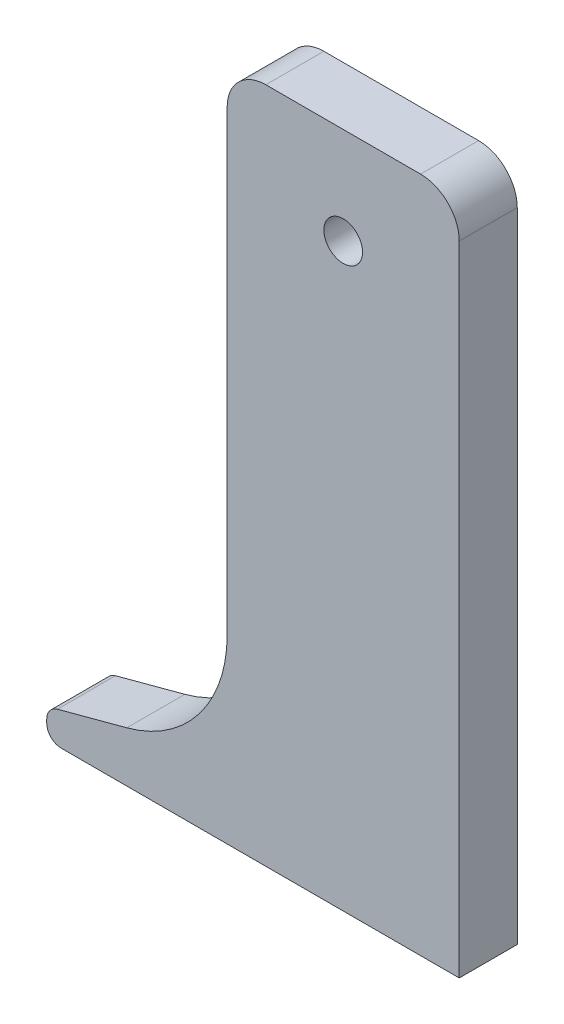
ISO-10303-21;
HEADER;
FILE_DESCRIPTION(('STEP AP214'),'2;1');
FILE_NAME('part.step','',(''),(''),'','','');
FILE_SCHEMA(('AUTOMOTIVE_DESIGN { 1 0 10303 214 1 1 1 1 }'));
ENDSEC;
DATA;
#1=APPLICATION_CONTEXT('core data for automotive mechanical design processes');
#2=APPLICATION_PROTOCOL_DEFINITION('international standard','automotive_design',2000,#1);
#3=PRODUCT_CONTEXT('',#1,'mechanical');
#4=PRODUCT('Part','Part','',(#3));
#5=PRODUCT_RELATED_PRODUCT_CATEGORY('part','',(#4));
#6=PRODUCT_DEFINITION_FORMATION('','',#4);
#7=PRODUCT_DEFINITION_CONTEXT('part definition',#1,'design');
#8=PRODUCT_DEFINITION('design','',#6,#7);
#9=PRODUCT_DEFINITION_SHAPE('','',#8);
#10=(LENGTH_UNIT() NAMED_UNIT(*) SI_UNIT(.MILLI.,.METRE.));
#11=(NAMED_UNIT(*) PLANE_ANGLE_UNIT() SI_UNIT($,.RADIAN.));
#12=(NAMED_UNIT(*) SI_UNIT($,.STERADIAN.) SOLID_ANGLE_UNIT());
#13=UNCERTAINTY_MEASURE_WITH_UNIT(LENGTH_MEASURE(1.E-05),#10,'distance_accuracy_value','');
#14=(GEOMETRIC_REPRESENTATION_CONTEXT(3) GLOBAL_UNCERTAINTY_ASSIGNED_CONTEXT((#13)) GLOBAL_UNIT_ASSIGNED_CONTEXT((#10,
#11,#12)) REPRESENTATION_CONTEXT('',''));
#15=CARTESIAN_POINT('',(0.,0.,0.));
#16=DIRECTION('',(0.,0.,1.));
#17=DIRECTION('',(1.,0.,0.));
#18=AXIS2_PLACEMENT_3D('',#15,#16,#17);
#19=CARTESIAN_POINT('',(-6.,0.,3.));
#20=DIRECTION('',(1.,0.,0.));
#21=DIRECTION('',(0.,1.,0.));
#22=AXIS2_PLACEMENT_3D('',#19,#20,#21);
#23=PLANE('',#22);
#24=DIRECTION('',(0.,-1.,0.));
#25=VECTOR('',#24,1.);
#26=CARTESIAN_POINT('',(-6.,0.,0.));
#27=LINE('',#26,#25);
#28=CARTESIAN_POINT('',(-6.,2.99999999999999,0.));
#29=VERTEX_POINT('',#28);
#30=CARTESIAN_POINT('',(-6.,-20.6287110841473,0.));
#31=VERTEX_POINT('',#30);
#32=EDGE_CURVE('E97',#29,#31,#27,.T.);
#33=ORIENTED_EDGE('',*,*,#32,.T.);
#34=DIRECTION('',(0.,0.,-1.));
#35=VECTOR('',#34,1.);
#36=CARTESIAN_POINT('',(-6.,-20.6287110841473,3.));
#37=LINE('',#36,#35);
#38=CARTESIAN_POINT('',(-6.,-20.6287110841473,3.));
#39=VERTEX_POINT('',#38);
#40=EDGE_CURVE('E11',#39,#31,#37,.T.);
#41=ORIENTED_EDGE('',*,*,#40,.F.);
#42=DIRECTION('',(0.,-1.,0.));
#43=VECTOR('',#42,1.);
#44=CARTESIAN_POINT('',(-6.,0.,3.));
#45=LINE('',#44,#43);
#46=CARTESIAN_POINT('',(-6.,2.99999999999999,3.));
#47=VERTEX_POINT('',#46);
#48=EDGE_CURVE('E103',#47,#39,#45,.T.);
#49=ORIENTED_EDGE('',*,*,#48,.F.);
#50=DIRECTION('',(0.,0.,-1.));
#51=VECTOR('',#50,1.);
#52=CARTESIAN_POINT('',(-6.,2.99999999999999,3.));
#53=LINE('',#52,#51);
#54=EDGE_CURVE('E146',#47,#29,#53,.T.);
#55=ORIENTED_EDGE('',*,*,#54,.T.);
#56=EDGE_LOOP('',(#33,#41,#49,#55));
#57=FACE_BOUND('',#56,.T.);
#58=ADVANCED_FACE('F36',(#57),#23,.F.);
#59=CARTESIAN_POINT('',(-13.,-20.6287110841473,3.));
#60=DIRECTION('',(0.,0.,-1.));
#61=DIRECTION('',(-1.,0.,0.));
#62=AXIS2_PLACEMENT_3D('',#59,#60,#61);
#63=CYLINDRICAL_SURFACE('',#62,7.);
#64=CARTESIAN_POINT('',(-13.,-20.6287110841473,0.));
#65=DIRECTION('',(0.,0.,-1.));
#66=DIRECTION('',(1.,0.,0.));
#67=AXIS2_PLACEMENT_3D('',#64,#65,#66);
#68=CIRCLE('',#67,7.);
#69=CARTESIAN_POINT('',(-11.1882666842824,-27.3901918681708,0.));
#70=VERTEX_POINT('',#69);
#71=EDGE_CURVE('E151',#31,#70,#68,.T.);
#72=ORIENTED_EDGE('',*,*,#71,.T.);
#73=DIRECTION('',(0.,0.,-1.));
#74=VECTOR('',#73,1.);
#75=CARTESIAN_POINT('',(-11.1882666842824,-27.3901918681708,3.));
#76=LINE('',#75,#74);
#77=CARTESIAN_POINT('',(-11.1882666842824,-27.3901918681708,3.));
#78=VERTEX_POINT('',#77);
#79=EDGE_CURVE('E44',#78,#70,#76,.T.);
#80=ORIENTED_EDGE('',*,*,#79,.F.);
#81=CARTESIAN_POINT('',(-13.,-20.6287110841473,3.));
#82=DIRECTION('',(0.,0.,-1.));
#83=DIRECTION('',(1.,0.,0.));
#84=AXIS2_PLACEMENT_3D('',#81,#82,#83);
#85=CIRCLE('',#84,7.);
#86=EDGE_CURVE('E232',#39,#78,#85,.T.);
#87=ORIENTED_EDGE('',*,*,#86,.F.);
#88=ORIENTED_EDGE('',*,*,#40,.T.);
#89=EDGE_LOOP('',(#72,#80,#87,#88));
#90=FACE_BOUND('',#89,.T.);
#91=ADVANCED_FACE('F237',(#90),#63,.F.);
#92=CARTESIAN_POINT('',(-14.7742413027489,-28.3510508712674,3.));
#93=DIRECTION('',(0.258819045102525,-0.965925826289067,0.));
#94=DIRECTION('',(0.965925826289067,0.258819045102525,0.));
#95=AXIS2_PLACEMENT_3D('',#92,#93,#94);
#96=PLANE('',#95);
#97=DIRECTION('',(-0.965925826289067,-0.258819045102525,0.));
#98=VECTOR('',#97,1.);
#99=CARTESIAN_POINT('',(-14.7742413027489,-28.3510508712674,0.));
#100=LINE('',#99,#98);
#101=CARTESIAN_POINT('',(-14.7742413027489,-28.3510508712674,0.));
#102=VERTEX_POINT('',#101);
#103=EDGE_CURVE('E154',#70,#102,#100,.T.);
#104=ORIENTED_EDGE('',*,*,#103,.T.);
#105=DIRECTION('',(0.,0.,-1.));
#106=VECTOR('',#105,1.);
#107=CARTESIAN_POINT('',(-14.7742413027489,-28.3510508712674,3.));
#108=LINE('',#107,#106);
#109=CARTESIAN_POINT('',(-14.7742413027489,-28.3510508712674,3.));
#110=VERTEX_POINT('',#109);
#111=EDGE_CURVE('E188',#110,#102,#108,.T.);
#112=ORIENTED_EDGE('',*,*,#111,.F.);
#113=DIRECTION('',(-0.965925826289067,-0.258819045102525,0.));
#114=VECTOR('',#113,1.);
#115=CARTESIAN_POINT('',(-14.7742413027489,-28.3510508712674,3.));
#116=LINE('',#115,#114);
#117=EDGE_CURVE('E197',#78,#110,#116,.T.);
#118=ORIENTED_EDGE('',*,*,#117,.F.);
#119=ORIENTED_EDGE('',*,*,#79,.T.);
#120=EDGE_LOOP('',(#104,#112,#118,#119));
#121=FACE_BOUND('',#120,.T.);
#122=ADVANCED_FACE('F195',(#121),#96,.F.);
#123=CARTESIAN_POINT('',(-14.580127018922,-29.0754952409842,3.));
#124=DIRECTION('',(0.,0.,-1.));
#125=DIRECTION('',(-1.,0.,0.));
#126=AXIS2_PLACEMENT_3D('',#123,#124,#125);
#127=CYLINDRICAL_SURFACE('',#126,0.749999999999999);
#128=CARTESIAN_POINT('',(-14.580127018922,-29.0754952409842,0.));
#129=DIRECTION('',(0.,0.,1.));
#130=DIRECTION('',(-1.,0.,0.));
#131=AXIS2_PLACEMENT_3D('',#128,#129,#130);
#132=CIRCLE('',#131,0.749999999999999);
#133=CARTESIAN_POINT('',(-15.330127018922,-29.0754952409842,0.));
#134=VERTEX_POINT('',#133);
#135=EDGE_CURVE('E156',#102,#134,#132,.T.);
#136=ORIENTED_EDGE('',*,*,#135,.T.);
#137=DIRECTION('',(0.,0.,-1.));
#138=VECTOR('',#137,1.);
#139=CARTESIAN_POINT('',(-15.330127018922,-29.0754952409842,3.));
#140=LINE('',#139,#138);
#141=CARTESIAN_POINT('',(-15.330127018922,-29.0754952409842,3.));
#142=VERTEX_POINT('',#141);
#143=EDGE_CURVE('E185',#142,#134,#140,.T.);
#144=ORIENTED_EDGE('',*,*,#143,.F.);
#145=CARTESIAN_POINT('',(-14.580127018922,-29.0754952409842,3.));
#146=DIRECTION('',(0.,0.,1.));
#147=DIRECTION('',(-1.,0.,0.));
#148=AXIS2_PLACEMENT_3D('',#145,#146,#147);
#149=CIRCLE('',#148,0.749999999999999);
#150=EDGE_CURVE('E215',#110,#142,#149,.T.);
#151=ORIENTED_EDGE('',*,*,#150,.F.);
#152=ORIENTED_EDGE('',*,*,#111,.T.);
#153=EDGE_LOOP('',(#136,#144,#151,#152));
#154=FACE_BOUND('',#153,.T.);
#155=ADVANCED_FACE('F206',(#154),#127,.T.);
#156=CARTESIAN_POINT('',(-15.330127018922,-29.25,3.));
#157=DIRECTION('',(1.,0.,0.));
#158=DIRECTION('',(0.,0.,-1.));
#159=AXIS2_PLACEMENT_3D('',#156,#157,#158);
#160=PLANE('',#159);
#161=DIRECTION('',(0.,-1.,0.));
#162=VECTOR('',#161,1.);
#163=CARTESIAN_POINT('',(-15.330127018922,-29.25,0.));
#164=LINE('',#163,#162);
#165=CARTESIAN_POINT('',(-15.330127018922,-29.25,0.));
#166=VERTEX_POINT('',#165);
#167=EDGE_CURVE('E158',#134,#166,#164,.T.);
#168=ORIENTED_EDGE('',*,*,#167,.T.);
#169=DIRECTION('',(0.,0.,-1.));
#170=VECTOR('',#169,1.);
#171=CARTESIAN_POINT('',(-15.330127018922,-29.25,3.));
#172=LINE('',#171,#170);
#173=CARTESIAN_POINT('',(-15.330127018922,-29.25,3.));
#174=VERTEX_POINT('',#173);
#175=EDGE_CURVE('E182',#174,#166,#172,.T.);
#176=ORIENTED_EDGE('',*,*,#175,.F.);
#177=DIRECTION('',(0.,-1.,0.));
#178=VECTOR('',#177,1.);
#179=CARTESIAN_POINT('',(-15.330127018922,-29.25,3.));
#180=LINE('',#179,#178);
#181=EDGE_CURVE('E212',#142,#174,#180,.T.);
#182=ORIENTED_EDGE('',*,*,#181,.F.);
#183=ORIENTED_EDGE('',*,*,#143,.T.);
#184=EDGE_LOOP('',(#168,#176,#182,#183));
#185=FACE_BOUND('',#184,.T.);
#186=ADVANCED_FACE('F210',(#185),#160,.F.);
#187=CARTESIAN_POINT('',(-14.580127018922,-29.25,3.));
#188=DIRECTION('',(0.,0.,-1.));
#189=DIRECTION('',(-1.,0.,0.));
#190=AXIS2_PLACEMENT_3D('',#187,#188,#189);
#191=CYLINDRICAL_SURFACE('',#190,0.750000000000001);
#192=CARTESIAN_POINT('',(-14.580127018922,-29.25,0.));
#193=DIRECTION('',(0.,0.,1.));
#194=DIRECTION('',(-1.,0.,0.));
#195=AXIS2_PLACEMENT_3D('',#192,#193,#194);
#196=CIRCLE('',#195,0.750000000000001);
#197=CARTESIAN_POINT('',(-14.580127018922,-30.,0.));
#198=VERTEX_POINT('',#197);
#199=EDGE_CURVE('E160',#166,#198,#196,.T.);
#200=ORIENTED_EDGE('',*,*,#199,.T.);
#201=DIRECTION('',(0.,0.,-1.));
#202=VECTOR('',#201,1.);
#203=CARTESIAN_POINT('',(-14.580127018922,-30.,3.));
#204=LINE('',#203,#202);
#205=CARTESIAN_POINT('',(-14.580127018922,-30.,3.));
#206=VERTEX_POINT('',#205);
#207=EDGE_CURVE('E179',#206,#198,#204,.T.);
#208=ORIENTED_EDGE('',*,*,#207,.F.);
#209=CARTESIAN_POINT('',(-14.580127018922,-29.25,3.));
#210=DIRECTION('',(0.,0.,1.));
#211=DIRECTION('',(-1.,0.,0.));
#212=AXIS2_PLACEMENT_3D('',#209,#210,#211);
#213=CIRCLE('',#212,0.750000000000001);
#214=EDGE_CURVE('E214',#174,#206,#213,.T.);
#215=ORIENTED_EDGE('',*,*,#214,.F.);
#216=ORIENTED_EDGE('',*,*,#175,.T.);
#217=EDGE_LOOP('',(#200,#208,#215,#216));
#218=FACE_BOUND('',#217,.T.);
#219=ADVANCED_FACE('F249',(#218),#191,.T.);
#220=CARTESIAN_POINT('',(-6.,-30.,3.));
#221=DIRECTION('',(0.,1.,0.));
#222=DIRECTION('',(0.,0.,1.));
#223=AXIS2_PLACEMENT_3D('',#220,#221,#222);
#224=PLANE('',#223);
#225=DIRECTION('',(1.,0.,0.));
#226=VECTOR('',#225,1.);
#227=CARTESIAN_POINT('',(-6.,-30.,0.));
#228=LINE('',#227,#226);
#229=CARTESIAN_POINT('',(6.,-30.,0.));
#230=VERTEX_POINT('',#229);
#231=EDGE_CURVE('E163',#198,#230,#228,.T.);
#232=ORIENTED_EDGE('',*,*,#231,.T.);
#233=DIRECTION('',(0.,0.,-1.));
#234=VECTOR('',#233,1.);
#235=CARTESIAN_POINT('',(6.,-30.,3.));
#236=LINE('',#235,#234);
#237=CARTESIAN_POINT('',(6.,-30.,3.));
#238=VERTEX_POINT('',#237);
#239=EDGE_CURVE('E176',#238,#230,#236,.T.);
#240=ORIENTED_EDGE('',*,*,#239,.F.);
#241=DIRECTION('',(1.,0.,0.));
#242=VECTOR('',#241,1.);
#243=CARTESIAN_POINT('',(-6.,-30.,3.));
#244=LINE('',#243,#242);
#245=EDGE_CURVE('E217',#206,#238,#244,.T.);
#246=ORIENTED_EDGE('',*,*,#245,.F.);
#247=ORIENTED_EDGE('',*,*,#207,.T.);
#248=EDGE_LOOP('',(#232,#240,#246,#247));
#249=FACE_BOUND('',#248,.T.);
#250=ADVANCED_FACE('F226',(#249),#224,.F.);
#251=CARTESIAN_POINT('',(6.,0.,3.));
#252=DIRECTION('',(-1.,0.,0.));
#253=DIRECTION('',(0.,-1.,0.));
#254=AXIS2_PLACEMENT_3D('',#251,#252,#253);
#255=PLANE('',#254);
#256=DIRECTION('',(0.,1.,0.));
#257=VECTOR('',#256,1.);
#258=CARTESIAN_POINT('',(6.,0.,0.));
#259=LINE('',#258,#257);
#260=CARTESIAN_POINT('',(6.,2.99999999999999,0.));
#261=VERTEX_POINT('',#260);
#262=EDGE_CURVE('E166',#230,#261,#259,.T.);
#263=ORIENTED_EDGE('',*,*,#262,.T.);
#264=DIRECTION('',(0.,0.,-1.));
#265=VECTOR('',#264,1.);
#266=CARTESIAN_POINT('',(6.,2.99999999999999,3.));
#267=LINE('',#266,#265);
#268=CARTESIAN_POINT('',(6.,2.99999999999999,3.));
#269=VERTEX_POINT('',#268);
#270=EDGE_CURVE('E141',#269,#261,#267,.T.);
#271=ORIENTED_EDGE('',*,*,#270,.F.);
#272=DIRECTION('',(0.,1.,0.));
#273=VECTOR('',#272,1.);
#274=CARTESIAN_POINT('',(6.,0.,3.));
#275=LINE('',#274,#273);
#276=EDGE_CURVE('E132',#238,#269,#275,.T.);
#277=ORIENTED_EDGE('',*,*,#276,.F.);
#278=ORIENTED_EDGE('',*,*,#239,.T.);
#279=EDGE_LOOP('',(#263,#271,#277,#278));
#280=FACE_BOUND('',#279,.T.);
#281=ADVANCED_FACE('F228',(#280),#255,.F.);
#282=CARTESIAN_POINT('',(4.,3.,3.));
#283=DIRECTION('',(0.,0.,-1.));
#284=DIRECTION('',(-1.,0.,0.));
#285=AXIS2_PLACEMENT_3D('',#282,#283,#284);
#286=CYLINDRICAL_SURFACE('',#285,2.);
#287=CARTESIAN_POINT('',(4.,3.,0.));
#288=DIRECTION('',(0.,0.,1.));
#289=DIRECTION('',(-1.,0.,0.));
#290=AXIS2_PLACEMENT_3D('',#287,#288,#289);
#291=CIRCLE('',#290,2.);
#292=CARTESIAN_POINT('',(3.99999999999998,5.,0.));
#293=VERTEX_POINT('',#292);
#294=EDGE_CURVE('E140',#261,#293,#291,.T.);
#295=ORIENTED_EDGE('',*,*,#294,.T.);
#296=DIRECTION('',(0.,0.,-1.));
#297=VECTOR('',#296,1.);
#298=CARTESIAN_POINT('',(3.99999999999998,5.,3.));
#299=LINE('',#298,#297);
#300=CARTESIAN_POINT('',(3.99999999999998,5.,3.));
#301=VERTEX_POINT('',#300);
#302=EDGE_CURVE('E137',#301,#293,#299,.T.);
#303=ORIENTED_EDGE('',*,*,#302,.F.);
#304=CARTESIAN_POINT('',(4.,3.,3.));
#305=DIRECTION('',(0.,0.,1.));
#306=DIRECTION('',(-1.,0.,0.));
#307=AXIS2_PLACEMENT_3D('',#304,#305,#306);
#308=CIRCLE('',#307,2.);
#309=EDGE_CURVE('E126',#269,#301,#308,.T.);
#310=ORIENTED_EDGE('',*,*,#309,.F.);
#311=ORIENTED_EDGE('',*,*,#270,.T.);
#312=EDGE_LOOP('',(#295,#303,#310,#311));
#313=FACE_BOUND('',#312,.T.);
#314=ADVANCED_FACE('F138',(#313),#286,.T.);
#315=CARTESIAN_POINT('',(-3.99999999999998,5.,3.));
#316=DIRECTION('',(0.,-1.,0.));
#317=DIRECTION('',(0.,0.,-1.));
#318=AXIS2_PLACEMENT_3D('',#315,#316,#317);
#319=PLANE('',#318);
#320=DIRECTION('',(-1.,0.,0.));
#321=VECTOR('',#320,1.);
#322=CARTESIAN_POINT('',(-3.99999999999998,5.,0.));
#323=LINE('',#322,#321);
#324=CARTESIAN_POINT('',(-3.99999999999998,5.,0.));
#325=VERTEX_POINT('',#324);
#326=EDGE_CURVE('E90',#293,#325,#323,.T.);
#327=ORIENTED_EDGE('',*,*,#326,.T.);
#328=DIRECTION('',(0.,0.,-1.));
#329=VECTOR('',#328,1.);
#330=CARTESIAN_POINT('',(-3.99999999999998,5.,3.));
#331=LINE('',#330,#329);
#332=CARTESIAN_POINT('',(-3.99999999999998,5.,3.));
#333=VERTEX_POINT('',#332);
#334=EDGE_CURVE('E142',#333,#325,#331,.T.);
#335=ORIENTED_EDGE('',*,*,#334,.F.);
#336=DIRECTION('',(-1.,0.,0.));
#337=VECTOR('',#336,1.);
#338=CARTESIAN_POINT('',(-3.99999999999998,5.,3.));
#339=LINE('',#338,#337);
#340=EDGE_CURVE('E130',#301,#333,#339,.T.);
#341=ORIENTED_EDGE('',*,*,#340,.F.);
#342=ORIENTED_EDGE('',*,*,#302,.T.);
#343=EDGE_LOOP('',(#327,#335,#341,#342));
#344=FACE_BOUND('',#343,.T.);
#345=ADVANCED_FACE('F144',(#344),#319,.F.);
#346=CARTESIAN_POINT('',(-4.,3.,3.));
#347=DIRECTION('',(0.,0.,-1.));
#348=DIRECTION('',(-1.,0.,0.));
#349=AXIS2_PLACEMENT_3D('',#346,#347,#348);
#350=CYLINDRICAL_SURFACE('',#349,2.);
#351=CARTESIAN_POINT('',(-4.,3.,0.));
#352=DIRECTION('',(0.,0.,1.));
#353=DIRECTION('',(-1.,0.,0.));
#354=AXIS2_PLACEMENT_3D('',#351,#352,#353);
#355=CIRCLE('',#354,2.);
#356=EDGE_CURVE('E170',#325,#29,#355,.T.);
#357=ORIENTED_EDGE('',*,*,#356,.T.);
#358=ORIENTED_EDGE('',*,*,#54,.F.);
#359=CARTESIAN_POINT('',(-4.,3.,3.));
#360=DIRECTION('',(0.,0.,1.));
#361=DIRECTION('',(-1.,0.,0.));
#362=AXIS2_PLACEMENT_3D('',#359,#360,#361);
#363=CIRCLE('',#362,2.);
#364=EDGE_CURVE('E52',#333,#47,#363,.T.);
#365=ORIENTED_EDGE('',*,*,#364,.F.);
#366=ORIENTED_EDGE('',*,*,#334,.T.);
#367=EDGE_LOOP('',(#357,#358,#365,#366));
#368=FACE_BOUND('',#367,.T.);
#369=ADVANCED_FACE('F230',(#368),#350,.T.);
#370=CARTESIAN_POINT('',(-4.,3.,3.));
#371=DIRECTION('',(0.,0.,-1.));
#372=DIRECTION('',(-1.,0.,0.));
#373=AXIS2_PLACEMENT_3D('',#370,#371,#372);
#374=PLANE('',#373);
#375=CARTESIAN_POINT('',(0.,0.,3.));
#376=DIRECTION('',(0.,0.,-1.));
#377=DIRECTION('',(-1.,0.,0.));
#378=AXIS2_PLACEMENT_3D('',#375,#376,#377);
#379=CIRCLE('',#378,1.);
#380=CARTESIAN_POINT('',(-1.,0.,3.));
#381=VERTEX_POINT('',#380);
#382=EDGE_CURVE('E152',#381,#381,#379,.T.);
#383=ORIENTED_EDGE('',*,*,#382,.T.);
#384=EDGE_LOOP('',(#383));
#385=FACE_BOUND('',#384,.T.);
#386=ORIENTED_EDGE('',*,*,#48,.T.);
#387=ORIENTED_EDGE('',*,*,#86,.T.);
#388=ORIENTED_EDGE('',*,*,#117,.T.);
#389=ORIENTED_EDGE('',*,*,#150,.T.);
#390=ORIENTED_EDGE('',*,*,#181,.T.);
#391=ORIENTED_EDGE('',*,*,#214,.T.);
#392=ORIENTED_EDGE('',*,*,#245,.T.);
#393=ORIENTED_EDGE('',*,*,#276,.T.);
#394=ORIENTED_EDGE('',*,*,#309,.T.);
#395=ORIENTED_EDGE('',*,*,#340,.T.);
#396=ORIENTED_EDGE('',*,*,#364,.T.);
#397=EDGE_LOOP('',(#386,#387,#388,#389,#390,#391,#392,#393,#394,#395,#396));
#398=FACE_BOUND('',#397,.T.);
#399=ADVANCED_FACE('F128',(#385,#398),#374,.F.);
#400=CARTESIAN_POINT('',(-4.,3.,0.));
#401=DIRECTION('',(0.,0.,-1.));
#402=DIRECTION('',(-1.,0.,0.));
#403=AXIS2_PLACEMENT_3D('',#400,#401,#402);
#404=PLANE('',#403);
#405=CARTESIAN_POINT('',(0.,0.,0.));
#406=DIRECTION('',(0.,0.,1.));
#407=DIRECTION('',(1.,0.,0.));
#408=AXIS2_PLACEMENT_3D('',#405,#406,#407);
#409=CIRCLE('',#408,1.);
#410=CARTESIAN_POINT('',(1.,0.,0.));
#411=VERTEX_POINT('',#410);
#412=EDGE_CURVE('E277',#411,#411,#409,.T.);
#413=ORIENTED_EDGE('',*,*,#412,.T.);
#414=EDGE_LOOP('',(#413));
#415=FACE_BOUND('',#414,.T.);
#416=ORIENTED_EDGE('',*,*,#32,.F.);
#417=ORIENTED_EDGE('',*,*,#356,.F.);
#418=ORIENTED_EDGE('',*,*,#326,.F.);
#419=ORIENTED_EDGE('',*,*,#294,.F.);
#420=ORIENTED_EDGE('',*,*,#262,.F.);
#421=ORIENTED_EDGE('',*,*,#231,.F.);
#422=ORIENTED_EDGE('',*,*,#199,.F.);
#423=ORIENTED_EDGE('',*,*,#167,.F.);
#424=ORIENTED_EDGE('',*,*,#135,.F.);
#425=ORIENTED_EDGE('',*,*,#103,.F.);
#426=ORIENTED_EDGE('',*,*,#71,.F.);
#427=EDGE_LOOP('',(#416,#417,#418,#419,#420,#421,#422,#423,#424,#425,#426));
#428=FACE_BOUND('',#427,.T.);
#429=ADVANCED_FACE('F201',(#415,#428),#404,.T.);
#430=CARTESIAN_POINT('',(0.,0.,0.));
#431=DIRECTION('',(0.,0.,1.));
#432=DIRECTION('',(1.,0.,0.));
#433=AXIS2_PLACEMENT_3D('',#430,#431,#432);
#434=CYLINDRICAL_SURFACE('',#433,1.);
#435=ORIENTED_EDGE('',*,*,#412,.F.);
#436=EDGE_LOOP('',(#435));
#437=FACE_BOUND('',#436,.T.);
#438=ORIENTED_EDGE('',*,*,#382,.F.);
#439=EDGE_LOOP('',(#438));
#440=FACE_BOUND('',#439,.T.);
#441=ADVANCED_FACE('F265',(#437,#440),#434,.F.);
#442=CLOSED_SHELL('',(#58,#91,#122,#155,#186,#219,#250,#281,#314,#345,#369,#399,#429,#441));
#443=MANIFOLD_SOLID_BREP('B2',#442);
#444=ADVANCED_BREP_SHAPE_REPRESENTATION('',(#18,#443),#14);
#445=SHAPE_DEFINITION_REPRESENTATION(#9,#444);
ENDSEC;
END-ISO-10303-21;
